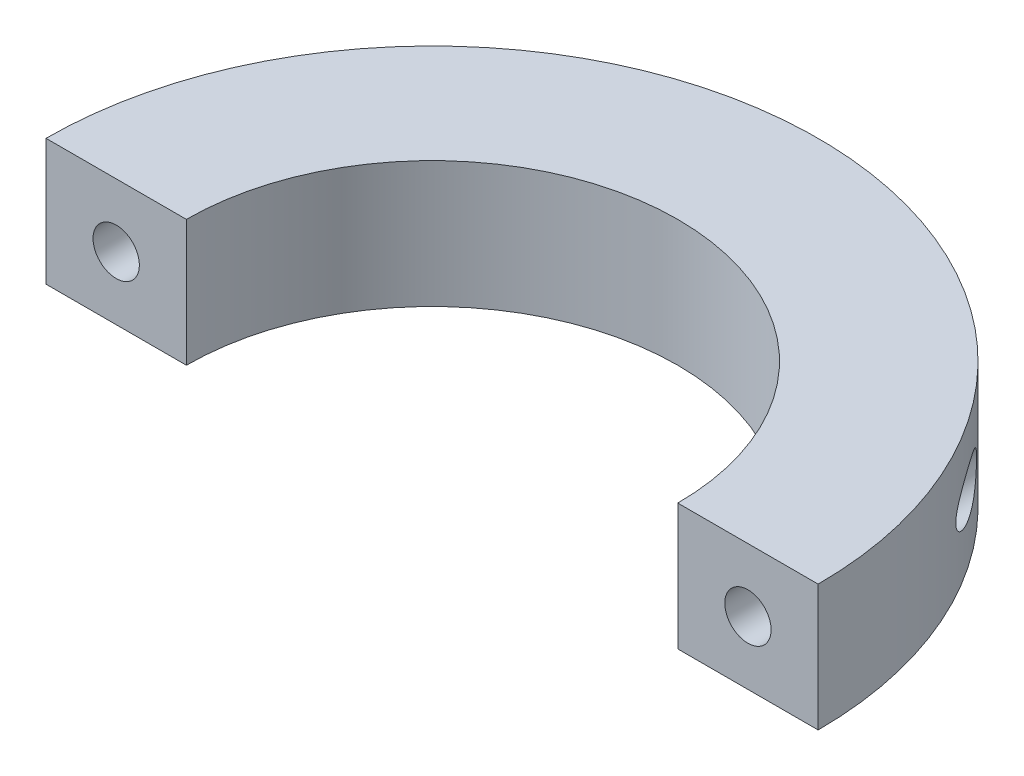
ISO-10303-21;
HEADER;
FILE_DESCRIPTION(('STEP AP214'),'2;1');
FILE_NAME('part.step','',(''),(''),'','','');
FILE_SCHEMA(('AUTOMOTIVE_DESIGN { 1 0 10303 214 1 1 1 1 }'));
ENDSEC;
DATA;
#1=APPLICATION_CONTEXT('core data for automotive mechanical design processes');
#2=APPLICATION_PROTOCOL_DEFINITION('international standard','automotive_design',2000,#1);
#3=PRODUCT_CONTEXT('',#1,'mechanical');
#4=PRODUCT('Part','Part','',(#3));
#5=PRODUCT_RELATED_PRODUCT_CATEGORY('part','',(#4));
#6=PRODUCT_DEFINITION_FORMATION('','',#4);
#7=PRODUCT_DEFINITION_CONTEXT('part definition',#1,'design');
#8=PRODUCT_DEFINITION('design','',#6,#7);
#9=PRODUCT_DEFINITION_SHAPE('','',#8);
#10=(LENGTH_UNIT() NAMED_UNIT(*) SI_UNIT(.MILLI.,.METRE.));
#11=(NAMED_UNIT(*) PLANE_ANGLE_UNIT() SI_UNIT($,.RADIAN.));
#12=(NAMED_UNIT(*) SI_UNIT($,.STERADIAN.) SOLID_ANGLE_UNIT());
#13=UNCERTAINTY_MEASURE_WITH_UNIT(LENGTH_MEASURE(1.E-05),#10,'distance_accuracy_value','');
#14=(GEOMETRIC_REPRESENTATION_CONTEXT(3) GLOBAL_UNCERTAINTY_ASSIGNED_CONTEXT((#13)) GLOBAL_UNIT_ASSIGNED_CONTEXT((#10,
#11,#12)) REPRESENTATION_CONTEXT('',''));
#15=CARTESIAN_POINT('',(0.,0.,0.));
#16=DIRECTION('',(0.,0.,1.));
#17=DIRECTION('',(1.,0.,0.));
#18=AXIS2_PLACEMENT_3D('',#15,#16,#17);
#19=CARTESIAN_POINT('',(0.,4.5,0.));
#20=DIRECTION('',(0.,-1.,0.));
#21=DIRECTION('',(0.,0.,-1.));
#22=AXIS2_PLACEMENT_3D('',#19,#20,#21);
#23=CYLINDRICAL_SURFACE('',#22,17.5);
#24=CARTESIAN_POINT('',(0.,-4.5,0.));
#25=DIRECTION('',(0.,-1.,0.));
#26=DIRECTION('',(0.,0.,1.));
#27=AXIS2_PLACEMENT_3D('',#24,#25,#26);
#28=CIRCLE('',#27,17.5);
#29=CARTESIAN_POINT('',(-17.5,-4.5,0.));
#30=VERTEX_POINT('',#29);
#31=CARTESIAN_POINT('',(17.5,-4.5,0.));
#32=VERTEX_POINT('',#31);
#33=EDGE_CURVE('E112',#30,#32,#28,.T.);
#34=ORIENTED_EDGE('',*,*,#33,.T.);
#35=DIRECTION('',(0.,-1.,0.));
#36=VECTOR('',#35,1.);
#37=CARTESIAN_POINT('',(17.5,4.5,0.));
#38=LINE('',#37,#36);
#39=CARTESIAN_POINT('',(17.5,4.5,0.));
#40=VERTEX_POINT('',#39);
#41=EDGE_CURVE('E11',#40,#32,#38,.T.);
#42=ORIENTED_EDGE('',*,*,#41,.F.);
#43=CARTESIAN_POINT('',(0.,4.5,0.));
#44=DIRECTION('',(0.,-1.,0.));
#45=DIRECTION('',(0.,0.,1.));
#46=AXIS2_PLACEMENT_3D('',#43,#44,#45);
#47=CIRCLE('',#46,17.5);
#48=CARTESIAN_POINT('',(-17.5,4.5,0.));
#49=VERTEX_POINT('',#48);
#50=EDGE_CURVE('E99',#49,#40,#47,.T.);
#51=ORIENTED_EDGE('',*,*,#50,.F.);
#52=DIRECTION('',(0.,-1.,0.));
#53=VECTOR('',#52,1.);
#54=CARTESIAN_POINT('',(-17.5,4.5,0.));
#55=LINE('',#54,#53);
#56=EDGE_CURVE('E108',#49,#30,#55,.T.);
#57=ORIENTED_EDGE('',*,*,#56,.T.);
#58=EDGE_LOOP('',(#34,#42,#51,#57));
#59=FACE_BOUND('',#58,.T.);
#60=ADVANCED_FACE('F41',(#59),#23,.F.);
#61=CARTESIAN_POINT('',(17.5,4.5,0.));
#62=DIRECTION('',(0.,0.,-1.));
#63=DIRECTION('',(-1.,0.,0.));
#64=AXIS2_PLACEMENT_3D('',#61,#62,#63);
#65=PLANE('',#64);
#66=CARTESIAN_POINT('',(22.5,0.,0.));
#67=DIRECTION('',(0.,0.,1.));
#68=DIRECTION('',(1.,0.,0.));
#69=AXIS2_PLACEMENT_3D('',#66,#67,#68);
#70=CIRCLE('',#69,1.65);
#71=CARTESIAN_POINT('',(24.15,0.,0.));
#72=VERTEX_POINT('',#71);
#73=EDGE_CURVE('E158',#72,#72,#70,.T.);
#74=ORIENTED_EDGE('',*,*,#73,.F.);
#75=EDGE_LOOP('',(#74));
#76=FACE_BOUND('',#75,.T.);
#77=DIRECTION('',(1.,0.,0.));
#78=VECTOR('',#77,1.);
#79=CARTESIAN_POINT('',(17.5,-4.5,0.));
#80=LINE('',#79,#78);
#81=CARTESIAN_POINT('',(27.5,-4.5,0.));
#82=VERTEX_POINT('',#81);
#83=EDGE_CURVE('E103',#32,#82,#80,.T.);
#84=ORIENTED_EDGE('',*,*,#83,.T.);
#85=DIRECTION('',(0.,-1.,0.));
#86=VECTOR('',#85,1.);
#87=CARTESIAN_POINT('',(27.5,4.5,0.));
#88=LINE('',#87,#86);
#89=CARTESIAN_POINT('',(27.5,4.5,0.));
#90=VERTEX_POINT('',#89);
#91=EDGE_CURVE('E55',#90,#82,#88,.T.);
#92=ORIENTED_EDGE('',*,*,#91,.F.);
#93=DIRECTION('',(1.,0.,0.));
#94=VECTOR('',#93,1.);
#95=CARTESIAN_POINT('',(17.5,4.5,0.));
#96=LINE('',#95,#94);
#97=EDGE_CURVE('E94',#40,#90,#96,.T.);
#98=ORIENTED_EDGE('',*,*,#97,.F.);
#99=ORIENTED_EDGE('',*,*,#41,.T.);
#100=EDGE_LOOP('',(#84,#92,#98,#99));
#101=FACE_BOUND('',#100,.T.);
#102=ADVANCED_FACE('F102',(#76,#101),#65,.F.);
#103=CARTESIAN_POINT('',(0.,4.5,0.));
#104=DIRECTION('',(0.,-1.,0.));
#105=DIRECTION('',(0.,0.,-1.));
#106=AXIS2_PLACEMENT_3D('',#103,#104,#105);
#107=CYLINDRICAL_SURFACE('',#106,27.5);
#108=CARTESIAN_POINT('',(24.15,0.,-13.1539917895672));
#109=CARTESIAN_POINT('',(24.1500012967851,0.0480855846631828,-13.1539892794972));
#110=CARTESIAN_POINT('',(24.1478780966239,0.0961629731167779,-13.1578896649268));
#111=CARTESIAN_POINT('',(24.1396218407128,0.190793770850737,-13.1730303696858));
#112=CARTESIAN_POINT('',(24.1334851687044,0.237345765945128,-13.184277308469));
#113=CARTESIAN_POINT('',(24.1158232893546,0.338955356602395,-13.2165606813965));
#114=CARTESIAN_POINT('',(24.103344028134,0.393289155010895,-13.2393244260919));
#115=CARTESIAN_POINT('',(24.0742706878816,0.497084233699139,-13.2921180579955));
#116=CARTESIAN_POINT('',(24.0576681715272,0.546535228768346,-13.3221628411358));
#117=CARTESIAN_POINT('',(24.0104734027408,0.668966051467918,-13.4071139935938));
#118=CARTESIAN_POINT('',(23.9774812456794,0.738158434845026,-13.466089076616));
#119=CARTESIAN_POINT('',(23.9064168293332,0.865940047026044,-13.5918544039183));
#120=CARTESIAN_POINT('',(23.8683313511807,0.924500717766579,-13.6586649263039));
#121=CARTESIAN_POINT('',(23.7911192648929,1.02930131260999,-13.7926882526084));
#122=CARTESIAN_POINT('',(23.7522117060243,1.07608694619049,-13.8596070713585));
#123=CARTESIAN_POINT('',(23.6719349538752,1.16300058786829,-13.9962776499302));
#124=CARTESIAN_POINT('',(23.6305637300057,1.20312299789989,-14.0660317311567));
#125=CARTESIAN_POINT('',(23.545745184874,1.27753810537496,-14.2075580161819));
#126=CARTESIAN_POINT('',(23.5022940227377,1.31181943914575,-14.2793338442782));
#127=CARTESIAN_POINT('',(23.4136727431665,1.37501352039309,-14.4241861911909));
#128=CARTESIAN_POINT('',(23.3685021259563,1.4039246924028,-14.4972630848377));
#129=CARTESIAN_POINT('',(23.2509366058127,1.47154140294036,-14.6854418968681));
#130=CARTESIAN_POINT('',(23.1774593205245,1.5066674547884,-14.8011648142856));
#131=CARTESIAN_POINT('',(23.0274043278604,1.56551476441723,-15.033556154166));
#132=CARTESIAN_POINT('',(22.9508247904594,1.58922918102607,-15.1502251012602));
#133=CARTESIAN_POINT('',(22.7950934846037,1.62536347250338,-15.3835424549002));
#134=CARTESIAN_POINT('',(22.715942542645,1.63778694000614,-15.5001908561637));
#135=CARTESIAN_POINT('',(22.5555617904059,1.65102521619863,-15.7326587646957));
#136=CARTESIAN_POINT('',(22.4743330663572,1.65184597118306,-15.8484786661412));
#137=CARTESIAN_POINT('',(22.3338542516827,1.64265917555593,-16.0455328868533));
#138=CARTESIAN_POINT('',(22.2749694480926,1.63568434097987,-16.1271760355773));
#139=CARTESIAN_POINT('',(22.1567241650088,1.61501217673428,-16.289248854822));
#140=CARTESIAN_POINT('',(22.0973638007277,1.60131642959936,-16.3696788064143));
#141=CARTESIAN_POINT('',(21.978633513619,1.56668278882957,-16.5287476119402));
#142=CARTESIAN_POINT('',(21.9192638015876,1.54575801662635,-16.6073894377371));
#143=CARTESIAN_POINT('',(21.8009458626778,1.49597449930892,-16.7624062900299));
#144=CARTESIAN_POINT('',(21.7419974479027,1.46711955123548,-16.838782382038));
#145=CARTESIAN_POINT('',(21.6102524314256,1.39211453433018,-17.0076798543743));
#146=CARTESIAN_POINT('',(21.5377632642128,1.3434296163305,-17.0993440503335));
#147=CARTESIAN_POINT('',(21.3966226618928,1.23013571713358,-17.2756251177115));
#148=CARTESIAN_POINT('',(21.3279668243602,1.1655454840604,-17.3602501304603));
#149=CARTESIAN_POINT('',(21.2155800501591,1.03821305503986,-17.4972793617571));
#150=CARTESIAN_POINT('',(21.1701378957717,0.979717057634499,-17.5521990515363));
#151=CARTESIAN_POINT('',(21.0851758462106,0.852412141433464,-17.6541705516839));
#152=CARTESIAN_POINT('',(21.0456465553448,0.783619939245342,-17.7012348585456));
#153=CARTESIAN_POINT('',(20.9834757439116,0.653131579942032,-17.774856119595));
#154=CARTESIAN_POINT('',(20.9590476050014,0.593551829839859,-17.8036341232945));
#155=CARTESIAN_POINT('',(20.9166982124806,0.469009141187395,-17.8533695677932));
#156=CARTESIAN_POINT('',(20.8987726004802,0.404049844339743,-17.8743322471616));
#157=CARTESIAN_POINT('',(20.8707146941236,0.269587935029068,-17.9070865532551));
#158=CARTESIAN_POINT('',(20.8606479448007,0.200052248587417,-17.9188010566096));
#159=CARTESIAN_POINT('',(20.8495596485808,0.0593045257024527,-17.9317021826163));
#160=CARTESIAN_POINT('',(20.8485320266621,-0.0119063525989533,-17.9328958761013));
#161=CARTESIAN_POINT('',(20.8551476304707,-0.144140361468523,-17.925200933558));
#162=CARTESIAN_POINT('',(20.8616973583316,-0.205300358826293,-17.9175838200212));
#163=CARTESIAN_POINT('',(20.881211397642,-0.325130247935277,-17.8948381673396));
#164=CARTESIAN_POINT('',(20.8941767272508,-0.383799742837279,-17.8797084359371));
#165=CARTESIAN_POINT('',(20.9260820680422,-0.498950867040866,-17.8423569342898));
#166=CARTESIAN_POINT('',(20.9451739574639,-0.555330640137801,-17.8199546924363));
#167=CARTESIAN_POINT('',(20.9881315068136,-0.663432926047098,-17.7693399457631));
#168=CARTESIAN_POINT('',(21.0119994136274,-0.715153230132921,-17.7411247060229));
#169=CARTESIAN_POINT('',(21.0787054129931,-0.842755060405562,-17.661884960297));
#170=CARTESIAN_POINT('',(21.1244256889953,-0.914880622107237,-17.6072267737919));
#171=CARTESIAN_POINT('',(21.2220721389144,-1.04698745873093,-17.4894129796928));
#172=CARTESIAN_POINT('',(21.2740149048227,-1.10693506191051,-17.4262345943871));
#173=CARTESIAN_POINT('',(21.4096542378363,-1.24385151328777,-17.2595875669979));
#174=CARTESIAN_POINT('',(21.4958560208638,-1.31354021160472,-17.1522074223637));
#175=CARTESIAN_POINT('',(21.6720100137678,-1.43114286228116,-16.9290974602413));
#176=CARTESIAN_POINT('',(21.7619685072116,-1.47901859555385,-16.8133533959449));
#177=CARTESIAN_POINT('',(21.9224334075807,-1.54748144527437,-16.6033210361633));
#178=CARTESIAN_POINT('',(21.9927618589283,-1.57178493523812,-16.5100655025164));
#179=CARTESIAN_POINT('',(22.1332145435824,-1.61036571415476,-16.3212946052329));
#180=CARTESIAN_POINT('',(22.2033386425303,-1.62463745407946,-16.2257780210495));
#181=CARTESIAN_POINT('',(22.3429078731294,-1.64401789510721,-16.0330490107348));
#182=CARTESIAN_POINT('',(22.4123512604299,-1.64910720310269,-15.9358334322491));
#183=CARTESIAN_POINT('',(22.549974537722,-1.65067773758867,-15.7404867268336));
#184=CARTESIAN_POINT('',(22.6181546761937,-1.64716067545188,-15.6423557857887));
#185=CARTESIAN_POINT('',(22.7559022023688,-1.63157237817121,-15.4413214396423));
#186=CARTESIAN_POINT('',(22.8253985121298,-1.61913135375458,-15.3383981282867));
#187=CARTESIAN_POINT('',(22.9623576373876,-1.58546538372775,-15.1325944186152));
#188=CARTESIAN_POINT('',(23.0298199021369,-1.56423808161592,-15.0297140392293));
#189=CARTESIAN_POINT('',(23.1621411704322,-1.51297313142435,-14.8249796027344));
#190=CARTESIAN_POINT('',(23.2270082112112,-1.4829655420497,-14.7231232506289));
#191=CARTESIAN_POINT('',(23.3539614461398,-1.41367646981621,-14.5209063246376));
#192=CARTESIAN_POINT('',(23.4160493528379,-1.37440079437294,-14.4205448557499));
#193=CARTESIAN_POINT('',(23.5313964013463,-1.28971303291429,-14.231461221389));
#194=CARTESIAN_POINT('',(23.5849425044526,-1.24519675522944,-14.1425171019517));
#195=CARTESIAN_POINT('',(23.6888133200882,-1.14646260819013,-13.9678370454368));
#196=CARTESIAN_POINT('',(23.7391310029049,-1.09222448271367,-13.8821082675685));
#197=CARTESIAN_POINT('',(23.8359609898786,-0.971486369428558,-13.7151854681502));
#198=CARTESIAN_POINT('',(23.8824222326473,-0.904851114406724,-13.6340557799399));
#199=CARTESIAN_POINT('',(23.9469532116969,-0.794121031967902,-13.5201833504668));
#200=CARTESIAN_POINT('',(23.9675745622511,-0.755485034949863,-13.4835817875053));
#201=CARTESIAN_POINT('',(24.0066493006922,-0.674197590353847,-13.4138873272505));
#202=CARTESIAN_POINT('',(24.0251053919118,-0.631551272208835,-13.3807900599814));
#203=CARTESIAN_POINT('',(24.0584354232692,-0.543940587740811,-13.3207661685236));
#204=CARTESIAN_POINT('',(24.0734352481701,-0.499173618357364,-13.2936254649844));
#205=CARTESIAN_POINT('',(24.1001062272452,-0.405610616919071,-13.2452121454752));
#206=CARTESIAN_POINT('',(24.1117799557276,-0.356817738736926,-13.2239349916975));
#207=CARTESIAN_POINT('',(24.1305272377889,-0.257550277698999,-13.1896940042401));
#208=CARTESIAN_POINT('',(24.1377537197547,-0.207202886412836,-13.1764540449808));
#209=CARTESIAN_POINT('',(24.1474861012896,-0.104565223315198,-13.1586103295675));
#210=CARTESIAN_POINT('',(24.1499985901589,-0.0522777678450348,-13.1539945184693));
#211=CARTESIAN_POINT('',(24.15,0.,-13.1539917895672));
#212=B_SPLINE_CURVE_WITH_KNOTS('',3,(#108,#109,#110,#111,#112,#113,#114,#115,#116,#117,#118,
#119,#120,#121,#122,#123,#124,#125,#126,#127,#128,#129,#130,#131,#132,#133,#134,#135,#136,#137,
#138,#139,#140,#141,#142,#143,#144,#145,#146,#147,#148,#149,#150,#151,#152,#153,#154,#155,#156,
#157,#158,#159,#160,#161,#162,#163,#164,#165,#166,#167,#168,#169,#170,#171,#172,#173,#174,#175,
#176,#177,#178,#179,#180,#181,#182,#183,#184,#185,#186,#187,#188,#189,#190,#191,#192,#193,#194,
#195,#196,#197,#198,#199,#200,#201,#202,#203,#204,#205,#206,#207,#208,#209,#210,#211),
.UNSPECIFIED.,.T.,.F.,(4,2,2,2,2,2,2,2,2,2,2,2,2,2,2,2,2,2,2,2,2,2,2,2,2,2,2,2,2,2,2,2,2,2,2,2,
2,2,2,2,2,2,2,2,2,2,2,2,2,2,2,4),(0.,0.144050000808198,0.288229974138972,0.467868548731362,
0.647877786879439,0.936405188629633,1.22569649888343,1.49664896953643,1.76782794006313,
2.03952860370979,2.3113088518535,2.73525942317788,3.15946383337941,3.58353321990881,
4.00738526648315,4.30989471087849,4.61233295926786,4.91422511017551,5.21597296343896,
5.594770624512,5.97312390370966,6.24890414145629,6.52424139260428,6.735039096792,
6.94569524930436,7.15809009895313,7.37034219124042,7.5554142534775,7.74051569617143,
7.93061535374657,8.12080465519151,8.42324302168081,8.72650656958947,9.18693980722416,
9.64817670895666,10.0056237653301,10.3632683870547,10.721667466626,11.079995284498,
11.4540988573815,11.828302830859,12.2012404391298,12.5739449810031,12.9123933664943,
13.2515553072695,13.5946616346636,13.7656696371271,13.93646181082,14.0993831289256,
14.2621780056796,14.4190059114653,14.5756144367245),.UNSPECIFIED.);
#213=CARTESIAN_POINT('',(24.15,0.,-13.1539917895672));
#214=VERTEX_POINT('',#213);
#215=EDGE_CURVE('E44',#214,#214,#212,.T.);
#216=ORIENTED_EDGE('',*,*,#215,.T.);
#217=EDGE_LOOP('',(#216));
#218=FACE_BOUND('',#217,.T.);
#219=CARTESIAN_POINT('',(-20.85,0.,-17.9311879137998));
#220=CARTESIAN_POINT('',(-20.8500040333626,0.069718905363318,-17.9311835417425));
#221=CARTESIAN_POINT('',(-20.8544614512043,0.139467061990727,-17.926004200888));
#222=CARTESIAN_POINT('',(-20.8718509353299,0.276428884789085,-17.905753425547));
#223=CARTESIAN_POINT('',(-20.8847913881335,0.343639973142854,-17.8906722018124));
#224=CARTESIAN_POINT('',(-20.9178593966029,0.473035093698601,-17.8519968027927));
#225=CARTESIAN_POINT('',(-20.9379315277388,0.53525347930461,-17.8284682622765));
#226=CARTESIAN_POINT('',(-20.983879627274,0.654180605783698,-17.7743651851994));
#227=CARTESIAN_POINT('',(-21.0097582434539,0.710886816121405,-17.7437874339948));
#228=CARTESIAN_POINT('',(-21.0787970319275,0.842900050841134,-17.6617754745499));
#229=CARTESIAN_POINT('',(-21.1244622058156,0.914927758144781,-17.6071825887978));
#230=CARTESIAN_POINT('',(-21.2219697665095,1.04685123822522,-17.4895366230988));
#231=CARTESIAN_POINT('',(-21.2738263903112,1.10671816020983,-17.4264640007016));
#232=CARTESIAN_POINT('',(-21.4093364548851,1.24357109112187,-17.2599813007027));
#233=CARTESIAN_POINT('',(-21.4954998026036,1.31326610141616,-17.1526533300347));
#234=CARTESIAN_POINT('',(-21.6715914844798,1.43089965467757,-16.9296328364764));
#235=CARTESIAN_POINT('',(-21.7615265689381,1.47879719846429,-16.8139250215576));
#236=CARTESIAN_POINT('',(-21.921951091902,1.54730088919647,-16.6039576116977));
#237=CARTESIAN_POINT('',(-21.9922619455268,1.57162303044509,-16.5107311738155));
#238=CARTESIAN_POINT('',(-22.1326812186356,1.61024364470068,-16.3220175804242));
#239=CARTESIAN_POINT('',(-22.2027895048448,1.62453657338486,-16.2265292045795));
#240=CARTESIAN_POINT('',(-22.3423262314074,1.64396160199808,-16.0338592639752));
#241=CARTESIAN_POINT('',(-22.4117529613042,1.64907465145953,-15.9366745997702));
#242=CARTESIAN_POINT('',(-22.5493447474461,1.65069603936661,-15.7413886747432));
#243=CARTESIAN_POINT('',(-22.6175100516141,1.64720608715358,-15.6432875998623));
#244=CARTESIAN_POINT('',(-22.7552323944341,1.63167665992063,-15.4423082677317));
#245=CARTESIAN_POINT('',(-22.8247183613269,1.61926715472109,-15.3394100229676));
#246=CARTESIAN_POINT('',(-22.9616587903658,1.58566825434335,-15.1336545968563));
#247=CARTESIAN_POINT('',(-23.0291127035489,1.56447650904377,-15.0307974338828));
#248=CARTESIAN_POINT('',(-23.1614199413889,1.51328762574233,-14.8261061926117));
#249=CARTESIAN_POINT('',(-23.2262812854103,1.48332049205331,-14.7242698313698));
#250=CARTESIAN_POINT('',(-23.3532261293887,1.41411912404944,-14.5220887285022));
#251=CARTESIAN_POINT('',(-23.4153113353619,1.37489067681845,-14.4217430968224));
#252=CARTESIAN_POINT('',(-23.530743452696,1.29023909528074,-14.2325419477062));
#253=CARTESIAN_POINT('',(-23.5843727165131,1.24569771049695,-14.1434683502278));
#254=CARTESIAN_POINT('',(-23.688405835204,1.14689036858651,-13.9685292318097));
#255=CARTESIAN_POINT('',(-23.7388025067324,1.0926037072744,-13.882671020824));
#256=CARTESIAN_POINT('',(-23.8357869230032,0.971734090427297,-13.7154890672904));
#257=CARTESIAN_POINT('',(-23.8823230698008,0.90501440192732,-13.6342303078694));
#258=CARTESIAN_POINT('',(-23.9469483785976,0.794132721638523,-13.5201921089074));
#259=CARTESIAN_POINT('',(-23.9675966611886,0.75544573151759,-13.4835426610881));
#260=CARTESIAN_POINT('',(-24.006719149832,0.674045594826268,-13.4137624547886));
#261=CARTESIAN_POINT('',(-24.0251961058822,0.631337667084988,-13.3806272508019));
#262=CARTESIAN_POINT('',(-24.0582113277541,0.544506317579475,-13.3211692160085));
#263=CARTESIAN_POINT('',(-24.0729295724522,0.50066477218144,-13.294540275104));
#264=CARTESIAN_POINT('',(-24.0991873544093,0.409101245056199,-13.246883024827));
#265=CARTESIAN_POINT('',(-24.1107283057587,0.361381001875547,-13.2258522240775));
#266=CARTESIAN_POINT('',(-24.1298756821689,0.261905443017349,-13.1908872999923));
#267=CARTESIAN_POINT('',(-24.1374331760345,0.210108540467163,-13.1770414644601));
#268=CARTESIAN_POINT('',(-24.1475417418937,0.104438486407944,-13.1585085990011));
#269=CARTESIAN_POINT('',(-24.1501007634452,0.0505687708847609,-13.1538070261126));
#270=CARTESIAN_POINT('',(-24.1499054632983,-0.0505311025555926,-13.1541651494126));
#271=CARTESIAN_POINT('',(-24.1477606183037,-0.097770407821442,-13.1581051664274));
#272=CARTESIAN_POINT('',(-24.1396007657561,-0.190769256290605,-13.1730689549295));
#273=CARTESIAN_POINT('',(-24.1335826408193,-0.236527576348245,-13.184098432313));
#274=CARTESIAN_POINT('',(-24.1162067717671,-0.337063562436532,-13.2158605812032));
#275=CARTESIAN_POINT('',(-24.1038689959367,-0.391102612610326,-13.2383678980184));
#276=CARTESIAN_POINT('',(-24.075112949204,-0.494376832256827,-13.2905917261802));
#277=CARTESIAN_POINT('',(-24.0586862822007,-0.543601823221798,-13.3203230682547));
#278=CARTESIAN_POINT('',(-24.0119368532554,-0.66561550764366,-13.4044904870692));
#279=CARTESIAN_POINT('',(-23.9792191982072,-0.734644629101789,-13.4629911290434));
#280=CARTESIAN_POINT('',(-23.9087166966781,-0.862172929844429,-13.5878054577171));
#281=CARTESIAN_POINT('',(-23.8709185431616,-0.920643477854811,-13.6541396048738));
#282=CARTESIAN_POINT('',(-23.7942942579411,-1.02529097013876,-13.7872071747025));
#283=CARTESIAN_POINT('',(-23.7556883986466,-1.07201493110318,-13.8536438534476));
#284=CARTESIAN_POINT('',(-23.6760256903362,-1.15885185182991,-13.9893534458019));
#285=CARTESIAN_POINT('',(-23.6349668189694,-1.1989592512846,-14.0586286844195));
#286=CARTESIAN_POINT('',(-23.5507840376782,-1.27338643547208,-14.1992006045821));
#287=CARTESIAN_POINT('',(-23.5076563436561,-1.30769505172868,-14.2705008848403));
#288=CARTESIAN_POINT('',(-23.4196911168097,-1.37098592351411,-14.4144090911514));
#289=CARTESIAN_POINT('',(-23.3748530838359,-1.39996660636715,-14.4870173963794));
#290=CARTESIAN_POINT('',(-23.2578263202981,-1.46800467738353,-14.6745253830535));
#291=CARTESIAN_POINT('',(-23.1845446253183,-1.50345863836731,-14.7900615941615));
#292=CARTESIAN_POINT('',(-23.0348720861114,-1.56297624323703,-15.0221090562147));
#293=CARTESIAN_POINT('',(-22.958479394476,-1.5870330087575,-15.1386208528879));
#294=CARTESIAN_POINT('',(-22.8031074288922,-1.62388360668749,-15.3716589132653));
#295=CARTESIAN_POINT('',(-22.7241288150714,-1.63668029064601,-15.4881851658282));
#296=CARTESIAN_POINT('',(-22.5640794002513,-1.65071016780225,-15.7204385888578));
#297=CARTESIAN_POINT('',(-22.4830096797306,-1.65194921741354,-15.8361661343301));
#298=CARTESIAN_POINT('',(-22.3423520593742,-1.64350751715975,-16.0337021741744));
#299=CARTESIAN_POINT('',(-22.2831290020182,-1.63679734675155,-16.1159041040765));
#300=CARTESIAN_POINT('',(-22.1641868024483,-1.61659168311947,-16.2790973279564));
#301=CARTESIAN_POINT('',(-22.104467779576,-1.60309777822081,-16.3600889007553));
#302=CARTESIAN_POINT('',(-21.9850056188119,-1.56880091491684,-16.5202750801147));
#303=CARTESIAN_POINT('',(-21.9252627301605,-1.54801153162608,-16.5994727353306));
#304=CARTESIAN_POINT('',(-21.8061846828355,-1.49842480218679,-16.7555944534011));
#305=CARTESIAN_POINT('',(-21.7468493407004,-1.46963133941078,-16.8325195988466));
#306=CARTESIAN_POINT('',(-21.6145430954222,-1.39485037690202,-17.0022288853815));
#307=CARTESIAN_POINT('',(-21.5418701113002,-1.34636424759476,-17.0941722796388));
#308=CARTESIAN_POINT('',(-21.4003255410259,-1.23344994951359,-17.2710402572412));
#309=CARTESIAN_POINT('',(-21.3314496725592,-1.16904020832064,-17.3559728033923));
#310=CARTESIAN_POINT('',(-21.2185607400307,-1.04190039020656,-17.4936664486004));
#311=CARTESIAN_POINT('',(-21.1728538520502,-0.983407123310678,-17.5489243849017));
#312=CARTESIAN_POINT('',(-21.0873544294021,-0.856033388349963,-17.6515698741759));
#313=CARTESIAN_POINT('',(-21.0475530703495,-0.787168734539485,-17.6989691826703));
#314=CARTESIAN_POINT('',(-20.9849604083612,-0.656575576790128,-17.7731038807353));
#315=CARTESIAN_POINT('',(-20.9603708939665,-0.596989587010822,-17.8020765934805));
#316=CARTESIAN_POINT('',(-20.9177129197634,-0.472421174386604,-17.8521811622913));
#317=CARTESIAN_POINT('',(-20.8996353966029,-0.407446407878333,-17.8733239172074));
#318=CARTESIAN_POINT('',(-20.8739340988859,-0.285588108660212,-17.9033291620709));
#319=CARTESIAN_POINT('',(-20.8650141696352,-0.229354079905753,-17.9137173012759));
#320=CARTESIAN_POINT('',(-20.8530457239389,-0.11541995914499,-17.9276481682503));
#321=CARTESIAN_POINT('',(-20.8499966607952,-0.0577200041535328,-17.9311915334086));
#322=CARTESIAN_POINT('',(-20.85,0.,-17.9311879137998));
#323=B_SPLINE_CURVE_WITH_KNOTS('',3,(#219,#220,#221,#222,#223,#224,#225,#226,#227,#228,#229,
#230,#231,#232,#233,#234,#235,#236,#237,#238,#239,#240,#241,#242,#243,#244,#245,#246,#247,#248,
#249,#250,#251,#252,#253,#254,#255,#256,#257,#258,#259,#260,#261,#262,#263,#264,#265,#266,#267,
#268,#269,#270,#271,#272,#273,#274,#275,#276,#277,#278,#279,#280,#281,#282,#283,#284,#285,#286,
#287,#288,#289,#290,#291,#292,#293,#294,#295,#296,#297,#298,#299,#300,#301,#302,#303,#304,#305,
#306,#307,#308,#309,#310,#311,#312,#313,#314,#315,#316,#317,#318,#319,#320,#321,#322),
.UNSPECIFIED.,.T.,.F.,(4,2,2,2,2,2,2,2,2,2,2,2,2,2,2,2,2,2,2,2,2,2,2,2,2,2,2,2,2,2,2,2,2,2,2,2,
2,2,2,2,2,2,2,2,2,2,2,2,2,2,2,4),(0.,0.208891013354144,0.417988853155219,0.62549598883333,
0.833097941609456,1.1351781817697,1.43796692905596,1.89823874102062,2.35937274280848,
2.71673204339056,3.07428874308668,3.43258660539635,3.79081328278608,4.16482834733374,
4.53894356274872,4.91179426946628,5.28441260808386,5.62331348405499,5.9629430768072,
6.30655550460995,6.47778795312762,6.64880114258427,6.80846895265364,6.96806558545816,
7.12957946137174,7.29083625619186,7.43244251097553,7.57416287938567,7.7526381150241,
7.93148289815486,8.21851901046149,8.50632214724257,8.77572254258389,9.04534819110763,
9.31548736390075,9.58570614759924,10.0091383690641,10.4328258132316,10.8564059301557,
11.2797714014948,11.5841731465443,11.8885036529645,12.1922708509086,12.4958909253164,
12.8753847656882,13.2544414763072,13.5312118758247,13.8075644513338,14.0187942136469,
14.2297288412361,14.4026849860044,14.5756250242279),.UNSPECIFIED.);
#324=CARTESIAN_POINT('',(-20.85,0.,-17.9311879137998));
#325=VERTEX_POINT('',#324);
#326=EDGE_CURVE('E115',#325,#325,#323,.T.);
#327=ORIENTED_EDGE('',*,*,#326,.T.);
#328=EDGE_LOOP('',(#327));
#329=FACE_BOUND('',#328,.T.);
#330=CARTESIAN_POINT('',(0.,-4.5,0.));
#331=DIRECTION('',(0.,1.,0.));
#332=DIRECTION('',(0.,0.,1.));
#333=AXIS2_PLACEMENT_3D('',#330,#331,#332);
#334=CIRCLE('',#333,27.5);
#335=CARTESIAN_POINT('',(-27.5,-4.5,0.));
#336=VERTEX_POINT('',#335);
#337=EDGE_CURVE('E81',#82,#336,#334,.T.);
#338=ORIENTED_EDGE('',*,*,#337,.T.);
#339=DIRECTION('',(0.,-1.,0.));
#340=VECTOR('',#339,1.);
#341=CARTESIAN_POINT('',(-27.5,4.5,0.));
#342=LINE('',#341,#340);
#343=CARTESIAN_POINT('',(-27.5,4.5,0.));
#344=VERTEX_POINT('',#343);
#345=EDGE_CURVE('E104',#344,#336,#342,.T.);
#346=ORIENTED_EDGE('',*,*,#345,.F.);
#347=CARTESIAN_POINT('',(0.,4.5,0.));
#348=DIRECTION('',(0.,1.,0.));
#349=DIRECTION('',(0.,0.,1.));
#350=AXIS2_PLACEMENT_3D('',#347,#348,#349);
#351=CIRCLE('',#350,27.5);
#352=EDGE_CURVE('E97',#90,#344,#351,.T.);
#353=ORIENTED_EDGE('',*,*,#352,.F.);
#354=ORIENTED_EDGE('',*,*,#91,.T.);
#355=EDGE_LOOP('',(#338,#346,#353,#354));
#356=FACE_BOUND('',#355,.T.);
#357=ADVANCED_FACE('F106',(#218,#329,#356),#107,.T.);
#358=CARTESIAN_POINT('',(-27.5,4.5,0.));
#359=DIRECTION('',(0.,0.,-1.));
#360=DIRECTION('',(-1.,0.,0.));
#361=AXIS2_PLACEMENT_3D('',#358,#359,#360);
#362=PLANE('',#361);
#363=CARTESIAN_POINT('',(-22.5,0.,0.));
#364=DIRECTION('',(0.,0.,1.));
#365=DIRECTION('',(1.,0.,0.));
#366=AXIS2_PLACEMENT_3D('',#363,#364,#365);
#367=CIRCLE('',#366,1.65);
#368=CARTESIAN_POINT('',(-20.85,0.,0.));
#369=VERTEX_POINT('',#368);
#370=EDGE_CURVE('E125',#369,#369,#367,.T.);
#371=ORIENTED_EDGE('',*,*,#370,.F.);
#372=EDGE_LOOP('',(#371));
#373=FACE_BOUND('',#372,.T.);
#374=DIRECTION('',(1.,0.,0.));
#375=VECTOR('',#374,1.);
#376=CARTESIAN_POINT('',(-27.5,-4.5,0.));
#377=LINE('',#376,#375);
#378=EDGE_CURVE('E87',#336,#30,#377,.T.);
#379=ORIENTED_EDGE('',*,*,#378,.T.);
#380=ORIENTED_EDGE('',*,*,#56,.F.);
#381=DIRECTION('',(1.,0.,0.));
#382=VECTOR('',#381,1.);
#383=CARTESIAN_POINT('',(-27.5,4.5,0.));
#384=LINE('',#383,#382);
#385=EDGE_CURVE('E64',#344,#49,#384,.T.);
#386=ORIENTED_EDGE('',*,*,#385,.F.);
#387=ORIENTED_EDGE('',*,*,#345,.T.);
#388=EDGE_LOOP('',(#379,#380,#386,#387));
#389=FACE_BOUND('',#388,.T.);
#390=ADVANCED_FACE('F138',(#373,#389),#362,.F.);
#391=CARTESIAN_POINT('',(0.,4.5,0.));
#392=DIRECTION('',(0.,1.,0.));
#393=DIRECTION('',(0.,0.,1.));
#394=AXIS2_PLACEMENT_3D('',#391,#392,#393);
#395=PLANE('',#394);
#396=ORIENTED_EDGE('',*,*,#50,.T.);
#397=ORIENTED_EDGE('',*,*,#97,.T.);
#398=ORIENTED_EDGE('',*,*,#352,.T.);
#399=ORIENTED_EDGE('',*,*,#385,.T.);
#400=EDGE_LOOP('',(#396,#397,#398,#399));
#401=FACE_BOUND('',#400,.T.);
#402=ADVANCED_FACE('F95',(#401),#395,.T.);
#403=CARTESIAN_POINT('',(0.,-4.5,0.));
#404=DIRECTION('',(0.,1.,0.));
#405=DIRECTION('',(0.,0.,1.));
#406=AXIS2_PLACEMENT_3D('',#403,#404,#405);
#407=PLANE('',#406);
#408=ORIENTED_EDGE('',*,*,#33,.F.);
#409=ORIENTED_EDGE('',*,*,#378,.F.);
#410=ORIENTED_EDGE('',*,*,#337,.F.);
#411=ORIENTED_EDGE('',*,*,#83,.F.);
#412=EDGE_LOOP('',(#408,#409,#410,#411));
#413=FACE_BOUND('',#412,.T.);
#414=ADVANCED_FACE('F133',(#413),#407,.F.);
#415=CARTESIAN_POINT('',(-22.5,0.,0.));
#416=DIRECTION('',(0.,0.,1.));
#417=DIRECTION('',(1.,0.,0.));
#418=AXIS2_PLACEMENT_3D('',#415,#416,#417);
#419=CYLINDRICAL_SURFACE('',#418,1.64999999999999);
#420=ORIENTED_EDGE('',*,*,#370,.T.);
#421=EDGE_LOOP('',(#420));
#422=FACE_BOUND('',#421,.T.);
#423=ORIENTED_EDGE('',*,*,#326,.F.);
#424=EDGE_LOOP('',(#423));
#425=FACE_BOUND('',#424,.T.);
#426=ADVANCED_FACE('F128',(#422,#425),#419,.F.);
#427=CARTESIAN_POINT('',(22.5,0.,0.));
#428=DIRECTION('',(0.,0.,1.));
#429=DIRECTION('',(1.,0.,0.));
#430=AXIS2_PLACEMENT_3D('',#427,#428,#429);
#431=CYLINDRICAL_SURFACE('',#430,1.64999999999999);
#432=ORIENTED_EDGE('',*,*,#73,.T.);
#433=EDGE_LOOP('',(#432));
#434=FACE_BOUND('',#433,.T.);
#435=ORIENTED_EDGE('',*,*,#215,.F.);
#436=EDGE_LOOP('',(#435));
#437=FACE_BOUND('',#436,.T.);
#438=ADVANCED_FACE('F132',(#434,#437),#431,.F.);
#439=CLOSED_SHELL('',(#60,#102,#357,#390,#402,#414,#426,#438));
#440=MANIFOLD_SOLID_BREP('B2',#439);
#441=ADVANCED_BREP_SHAPE_REPRESENTATION('',(#18,#440),#14);
#442=SHAPE_DEFINITION_REPRESENTATION(#9,#441);
ENDSEC;
END-ISO-10303-21;
